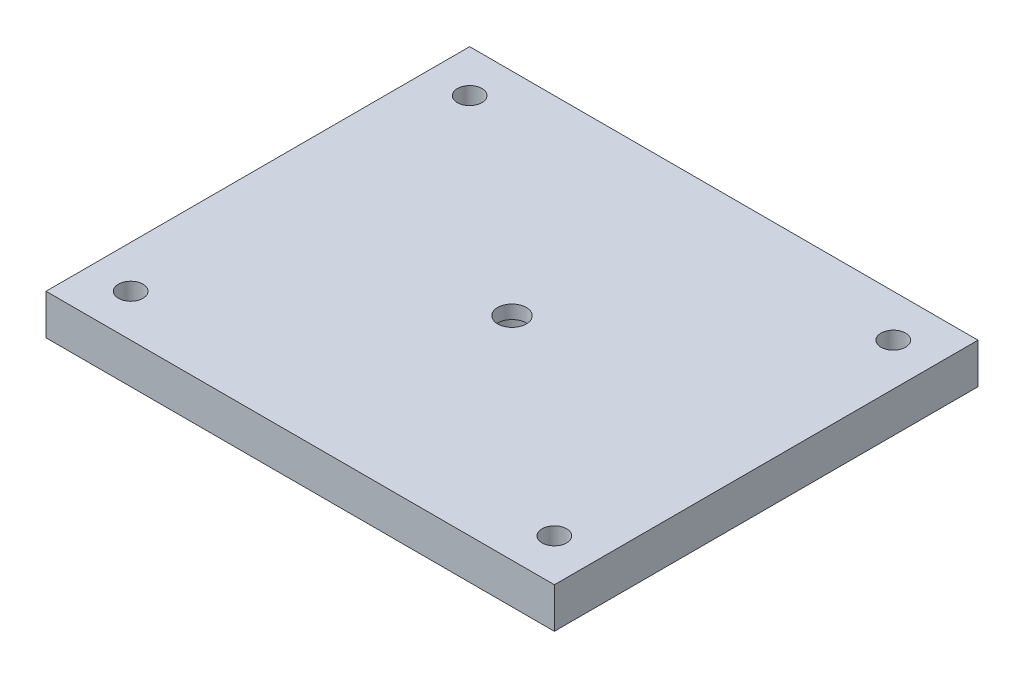
ISO-10303-21;
HEADER;
FILE_DESCRIPTION(('STEP AP214'),'2;1');
FILE_NAME('part.step','',(''),(''),'','','');
FILE_SCHEMA(('AUTOMOTIVE_DESIGN { 1 0 10303 214 1 1 1 1 }'));
ENDSEC;
DATA;
#1=APPLICATION_CONTEXT('core data for automotive mechanical design processes');
#2=APPLICATION_PROTOCOL_DEFINITION('international standard','automotive_design',2000,#1);
#3=PRODUCT_CONTEXT('',#1,'mechanical');
#4=PRODUCT('Part','Part','',(#3));
#5=PRODUCT_RELATED_PRODUCT_CATEGORY('part','',(#4));
#6=PRODUCT_DEFINITION_FORMATION('','',#4);
#7=PRODUCT_DEFINITION_CONTEXT('part definition',#1,'design');
#8=PRODUCT_DEFINITION('design','',#6,#7);
#9=PRODUCT_DEFINITION_SHAPE('','',#8);
#10=(LENGTH_UNIT() NAMED_UNIT(*) SI_UNIT(.MILLI.,.METRE.));
#11=(NAMED_UNIT(*) PLANE_ANGLE_UNIT() SI_UNIT($,.RADIAN.));
#12=(NAMED_UNIT(*) SI_UNIT($,.STERADIAN.) SOLID_ANGLE_UNIT());
#13=UNCERTAINTY_MEASURE_WITH_UNIT(LENGTH_MEASURE(1.E-05),#10,'distance_accuracy_value','');
#14=(GEOMETRIC_REPRESENTATION_CONTEXT(3) GLOBAL_UNCERTAINTY_ASSIGNED_CONTEXT((#13)) GLOBAL_UNIT_ASSIGNED_CONTEXT((#10,
#11,#12)) REPRESENTATION_CONTEXT('',''));
#15=CARTESIAN_POINT('',(0.,0.,0.));
#16=DIRECTION('',(0.,0.,1.));
#17=DIRECTION('',(1.,0.,0.));
#18=AXIS2_PLACEMENT_3D('',#15,#16,#17);
#19=CARTESIAN_POINT('',(-60.,9.525,50.));
#20=DIRECTION('',(1.,0.,0.));
#21=DIRECTION('',(0.,0.,-1.));
#22=AXIS2_PLACEMENT_3D('',#19,#20,#21);
#23=PLANE('',#22);
#24=DIRECTION('',(0.,0.,1.));
#25=VECTOR('',#24,1.);
#26=CARTESIAN_POINT('',(-60.,0.,50.));
#27=LINE('',#26,#25);
#28=CARTESIAN_POINT('',(-60.,0.,-50.));
#29=VERTEX_POINT('',#28);
#30=CARTESIAN_POINT('',(-60.,0.,50.));
#31=VERTEX_POINT('',#30);
#32=EDGE_CURVE('E95',#29,#31,#27,.T.);
#33=ORIENTED_EDGE('',*,*,#32,.T.);
#34=DIRECTION('',(0.,-1.,0.));
#35=VECTOR('',#34,1.);
#36=CARTESIAN_POINT('',(-60.,9.525,50.));
#37=LINE('',#36,#35);
#38=CARTESIAN_POINT('',(-60.,9.525,50.));
#39=VERTEX_POINT('',#38);
#40=EDGE_CURVE('E11',#39,#31,#37,.T.);
#41=ORIENTED_EDGE('',*,*,#40,.F.);
#42=DIRECTION('',(0.,0.,1.));
#43=VECTOR('',#42,1.);
#44=CARTESIAN_POINT('',(-60.,9.525,50.));
#45=LINE('',#44,#43);
#46=CARTESIAN_POINT('',(-60.,9.525,-50.));
#47=VERTEX_POINT('',#46);
#48=EDGE_CURVE('E83',#47,#39,#45,.T.);
#49=ORIENTED_EDGE('',*,*,#48,.F.);
#50=DIRECTION('',(0.,-1.,0.));
#51=VECTOR('',#50,1.);
#52=CARTESIAN_POINT('',(-60.,9.525,-50.));
#53=LINE('',#52,#51);
#54=EDGE_CURVE('E91',#47,#29,#53,.T.);
#55=ORIENTED_EDGE('',*,*,#54,.T.);
#56=EDGE_LOOP('',(#33,#41,#49,#55));
#57=FACE_BOUND('',#56,.T.);
#58=ADVANCED_FACE('F32',(#57),#23,.F.);
#59=CARTESIAN_POINT('',(60.,9.525,50.));
#60=DIRECTION('',(0.,0.,-1.));
#61=DIRECTION('',(-1.,0.,0.));
#62=AXIS2_PLACEMENT_3D('',#59,#60,#61);
#63=PLANE('',#62);
#64=DIRECTION('',(1.,0.,0.));
#65=VECTOR('',#64,1.);
#66=CARTESIAN_POINT('',(60.,0.,50.));
#67=LINE('',#66,#65);
#68=CARTESIAN_POINT('',(60.,0.,50.));
#69=VERTEX_POINT('',#68);
#70=EDGE_CURVE('E87',#31,#69,#67,.T.);
#71=ORIENTED_EDGE('',*,*,#70,.T.);
#72=DIRECTION('',(0.,-1.,0.));
#73=VECTOR('',#72,1.);
#74=CARTESIAN_POINT('',(60.,9.525,50.));
#75=LINE('',#74,#73);
#76=CARTESIAN_POINT('',(60.,9.525,50.));
#77=VERTEX_POINT('',#76);
#78=EDGE_CURVE('E40',#77,#69,#75,.T.);
#79=ORIENTED_EDGE('',*,*,#78,.F.);
#80=DIRECTION('',(1.,0.,0.));
#81=VECTOR('',#80,1.);
#82=CARTESIAN_POINT('',(60.,9.525,50.));
#83=LINE('',#82,#81);
#84=EDGE_CURVE('E78',#39,#77,#83,.T.);
#85=ORIENTED_EDGE('',*,*,#84,.F.);
#86=ORIENTED_EDGE('',*,*,#40,.T.);
#87=EDGE_LOOP('',(#71,#79,#85,#86));
#88=FACE_BOUND('',#87,.T.);
#89=ADVANCED_FACE('F86',(#88),#63,.F.);
#90=CARTESIAN_POINT('',(60.,9.525,50.));
#91=DIRECTION('',(-1.,0.,0.));
#92=DIRECTION('',(0.,0.,1.));
#93=AXIS2_PLACEMENT_3D('',#90,#91,#92);
#94=PLANE('',#93);
#95=DIRECTION('',(0.,0.,-1.));
#96=VECTOR('',#95,1.);
#97=CARTESIAN_POINT('',(60.,0.,50.));
#98=LINE('',#97,#96);
#99=CARTESIAN_POINT('',(60.,0.,-50.));
#100=VERTEX_POINT('',#99);
#101=EDGE_CURVE('E65',#69,#100,#98,.T.);
#102=ORIENTED_EDGE('',*,*,#101,.T.);
#103=DIRECTION('',(0.,-1.,0.));
#104=VECTOR('',#103,1.);
#105=CARTESIAN_POINT('',(60.,9.525,-50.));
#106=LINE('',#105,#104);
#107=CARTESIAN_POINT('',(60.,9.525,-50.));
#108=VERTEX_POINT('',#107);
#109=EDGE_CURVE('E88',#108,#100,#106,.T.);
#110=ORIENTED_EDGE('',*,*,#109,.F.);
#111=DIRECTION('',(0.,0.,-1.));
#112=VECTOR('',#111,1.);
#113=CARTESIAN_POINT('',(60.,9.525,50.));
#114=LINE('',#113,#112);
#115=EDGE_CURVE('E81',#77,#108,#114,.T.);
#116=ORIENTED_EDGE('',*,*,#115,.F.);
#117=ORIENTED_EDGE('',*,*,#78,.T.);
#118=EDGE_LOOP('',(#102,#110,#116,#117));
#119=FACE_BOUND('',#118,.T.);
#120=ADVANCED_FACE('F89',(#119),#94,.F.);
#121=CARTESIAN_POINT('',(60.,9.525,-50.));
#122=DIRECTION('',(0.,0.,1.));
#123=DIRECTION('',(1.,0.,0.));
#124=AXIS2_PLACEMENT_3D('',#121,#122,#123);
#125=PLANE('',#124);
#126=DIRECTION('',(-1.,0.,0.));
#127=VECTOR('',#126,1.);
#128=CARTESIAN_POINT('',(60.,0.,-50.));
#129=LINE('',#128,#127);
#130=EDGE_CURVE('E71',#100,#29,#129,.T.);
#131=ORIENTED_EDGE('',*,*,#130,.T.);
#132=ORIENTED_EDGE('',*,*,#54,.F.);
#133=DIRECTION('',(-1.,0.,0.));
#134=VECTOR('',#133,1.);
#135=CARTESIAN_POINT('',(60.,9.525,-50.));
#136=LINE('',#135,#134);
#137=EDGE_CURVE('E48',#108,#47,#136,.T.);
#138=ORIENTED_EDGE('',*,*,#137,.F.);
#139=ORIENTED_EDGE('',*,*,#109,.T.);
#140=EDGE_LOOP('',(#131,#132,#138,#139));
#141=FACE_BOUND('',#140,.T.);
#142=ADVANCED_FACE('F103',(#141),#125,.F.);
#143=CARTESIAN_POINT('',(0.,9.525,0.));
#144=DIRECTION('',(0.,1.,0.));
#145=DIRECTION('',(0.,0.,1.));
#146=AXIS2_PLACEMENT_3D('',#143,#144,#145);
#147=PLANE('',#146);
#148=CARTESIAN_POINT('',(0.,9.525,0.));
#149=DIRECTION('',(0.,-1.,0.));
#150=DIRECTION('',(0.,0.,-1.));
#151=AXIS2_PLACEMENT_3D('',#148,#149,#150);
#152=CIRCLE('',#151,3.3782);
#153=CARTESIAN_POINT('',(0.,9.525,-3.3782));
#154=VERTEX_POINT('',#153);
#155=EDGE_CURVE('E132',#154,#154,#152,.T.);
#156=ORIENTED_EDGE('',*,*,#155,.T.);
#157=EDGE_LOOP('',(#156));
#158=FACE_BOUND('',#157,.T.);
#159=CARTESIAN_POINT('',(-50.,9.525,40.));
#160=DIRECTION('',(0.,1.,0.));
#161=DIRECTION('',(0.,0.,1.));
#162=AXIS2_PLACEMENT_3D('',#159,#160,#161);
#163=CIRCLE('',#162,2.89999999999999);
#164=CARTESIAN_POINT('',(-50.,9.525,42.9));
#165=VERTEX_POINT('',#164);
#166=EDGE_CURVE('E129',#165,#165,#163,.T.);
#167=ORIENTED_EDGE('',*,*,#166,.F.);
#168=EDGE_LOOP('',(#167));
#169=FACE_BOUND('',#168,.T.);
#170=CARTESIAN_POINT('',(-50.,9.525,-40.));
#171=DIRECTION('',(0.,1.,0.));
#172=DIRECTION('',(0.,0.,1.));
#173=AXIS2_PLACEMENT_3D('',#170,#171,#172);
#174=CIRCLE('',#173,2.89999999999999);
#175=CARTESIAN_POINT('',(-50.,9.525,-37.1));
#176=VERTEX_POINT('',#175);
#177=EDGE_CURVE('E123',#176,#176,#174,.T.);
#178=ORIENTED_EDGE('',*,*,#177,.F.);
#179=EDGE_LOOP('',(#178));
#180=FACE_BOUND('',#179,.T.);
#181=CARTESIAN_POINT('',(50.,9.525,-40.));
#182=DIRECTION('',(0.,1.,0.));
#183=DIRECTION('',(0.,0.,1.));
#184=AXIS2_PLACEMENT_3D('',#181,#182,#183);
#185=CIRCLE('',#184,2.89999999999999);
#186=CARTESIAN_POINT('',(50.,9.525,-37.1));
#187=VERTEX_POINT('',#186);
#188=EDGE_CURVE('E117',#187,#187,#185,.T.);
#189=ORIENTED_EDGE('',*,*,#188,.F.);
#190=EDGE_LOOP('',(#189));
#191=FACE_BOUND('',#190,.T.);
#192=CARTESIAN_POINT('',(50.,9.525,40.));
#193=DIRECTION('',(0.,1.,0.));
#194=DIRECTION('',(0.,0.,1.));
#195=AXIS2_PLACEMENT_3D('',#192,#193,#194);
#196=CIRCLE('',#195,2.89999999999999);
#197=CARTESIAN_POINT('',(50.,9.525,42.9));
#198=VERTEX_POINT('',#197);
#199=EDGE_CURVE('E111',#198,#198,#196,.T.);
#200=ORIENTED_EDGE('',*,*,#199,.F.);
#201=EDGE_LOOP('',(#200));
#202=FACE_BOUND('',#201,.T.);
#203=ORIENTED_EDGE('',*,*,#48,.T.);
#204=ORIENTED_EDGE('',*,*,#84,.T.);
#205=ORIENTED_EDGE('',*,*,#115,.T.);
#206=ORIENTED_EDGE('',*,*,#137,.T.);
#207=EDGE_LOOP('',(#203,#204,#205,#206));
#208=FACE_BOUND('',#207,.T.);
#209=ADVANCED_FACE('F79',(#158,#169,#180,#191,#202,#208),#147,.T.);
#210=CARTESIAN_POINT('',(0.,0.,0.));
#211=DIRECTION('',(0.,1.,0.));
#212=DIRECTION('',(0.,0.,1.));
#213=AXIS2_PLACEMENT_3D('',#210,#211,#212);
#214=PLANE('',#213);
#215=CARTESIAN_POINT('',(0.,0.,0.));
#216=DIRECTION('',(0.,-1.,0.));
#217=DIRECTION('',(0.,0.,-1.));
#218=AXIS2_PLACEMENT_3D('',#215,#216,#217);
#219=CIRCLE('',#218,5.55625);
#220=CARTESIAN_POINT('',(0.,0.,-5.55625));
#221=VERTEX_POINT('',#220);
#222=EDGE_CURVE('E141',#221,#221,#219,.T.);
#223=ORIENTED_EDGE('',*,*,#222,.F.);
#224=EDGE_LOOP('',(#223));
#225=FACE_BOUND('',#224,.T.);
#226=CARTESIAN_POINT('',(-50.,0.,40.));
#227=DIRECTION('',(0.,1.,0.));
#228=DIRECTION('',(0.,0.,1.));
#229=AXIS2_PLACEMENT_3D('',#226,#227,#228);
#230=CIRCLE('',#229,2.9);
#231=CARTESIAN_POINT('',(-50.,0.,42.9));
#232=VERTEX_POINT('',#231);
#233=EDGE_CURVE('E126',#232,#232,#230,.T.);
#234=ORIENTED_EDGE('',*,*,#233,.T.);
#235=EDGE_LOOP('',(#234));
#236=FACE_BOUND('',#235,.T.);
#237=CARTESIAN_POINT('',(-50.,0.,-40.));
#238=DIRECTION('',(0.,1.,0.));
#239=DIRECTION('',(0.,0.,1.));
#240=AXIS2_PLACEMENT_3D('',#237,#238,#239);
#241=CIRCLE('',#240,2.9);
#242=CARTESIAN_POINT('',(-50.,0.,-37.1));
#243=VERTEX_POINT('',#242);
#244=EDGE_CURVE('E120',#243,#243,#241,.T.);
#245=ORIENTED_EDGE('',*,*,#244,.T.);
#246=EDGE_LOOP('',(#245));
#247=FACE_BOUND('',#246,.T.);
#248=CARTESIAN_POINT('',(50.,0.,-40.));
#249=DIRECTION('',(0.,1.,0.));
#250=DIRECTION('',(0.,0.,1.));
#251=AXIS2_PLACEMENT_3D('',#248,#249,#250);
#252=CIRCLE('',#251,2.9);
#253=CARTESIAN_POINT('',(50.,0.,-37.1));
#254=VERTEX_POINT('',#253);
#255=EDGE_CURVE('E114',#254,#254,#252,.T.);
#256=ORIENTED_EDGE('',*,*,#255,.T.);
#257=EDGE_LOOP('',(#256));
#258=FACE_BOUND('',#257,.T.);
#259=CARTESIAN_POINT('',(50.,0.,40.));
#260=DIRECTION('',(0.,1.,0.));
#261=DIRECTION('',(0.,0.,1.));
#262=AXIS2_PLACEMENT_3D('',#259,#260,#261);
#263=CIRCLE('',#262,2.9);
#264=CARTESIAN_POINT('',(50.,0.,42.9));
#265=VERTEX_POINT('',#264);
#266=EDGE_CURVE('E98',#265,#265,#263,.T.);
#267=ORIENTED_EDGE('',*,*,#266,.T.);
#268=EDGE_LOOP('',(#267));
#269=FACE_BOUND('',#268,.T.);
#270=ORIENTED_EDGE('',*,*,#32,.F.);
#271=ORIENTED_EDGE('',*,*,#130,.F.);
#272=ORIENTED_EDGE('',*,*,#101,.F.);
#273=ORIENTED_EDGE('',*,*,#70,.F.);
#274=EDGE_LOOP('',(#270,#271,#272,#273));
#275=FACE_BOUND('',#274,.T.);
#276=ADVANCED_FACE('F106',(#225,#236,#247,#258,#269,#275),#214,.F.);
#277=CARTESIAN_POINT('',(50.,9.525,40.));
#278=DIRECTION('',(0.,1.,0.));
#279=DIRECTION('',(0.,0.,1.));
#280=AXIS2_PLACEMENT_3D('',#277,#278,#279);
#281=CYLINDRICAL_SURFACE('',#280,2.89999999999999);
#282=ORIENTED_EDGE('',*,*,#266,.F.);
#283=EDGE_LOOP('',(#282));
#284=FACE_BOUND('',#283,.T.);
#285=ORIENTED_EDGE('',*,*,#199,.T.);
#286=EDGE_LOOP('',(#285));
#287=FACE_BOUND('',#286,.T.);
#288=ADVANCED_FACE('F149',(#284,#287),#281,.F.);
#289=CARTESIAN_POINT('',(50.,9.525,-40.));
#290=DIRECTION('',(0.,1.,0.));
#291=DIRECTION('',(0.,0.,1.));
#292=AXIS2_PLACEMENT_3D('',#289,#290,#291);
#293=CYLINDRICAL_SURFACE('',#292,2.89999999999999);
#294=ORIENTED_EDGE('',*,*,#255,.F.);
#295=EDGE_LOOP('',(#294));
#296=FACE_BOUND('',#295,.T.);
#297=ORIENTED_EDGE('',*,*,#188,.T.);
#298=EDGE_LOOP('',(#297));
#299=FACE_BOUND('',#298,.T.);
#300=ADVANCED_FACE('F161',(#296,#299),#293,.F.);
#301=CARTESIAN_POINT('',(-50.,9.525,-40.));
#302=DIRECTION('',(0.,1.,0.));
#303=DIRECTION('',(0.,0.,1.));
#304=AXIS2_PLACEMENT_3D('',#301,#302,#303);
#305=CYLINDRICAL_SURFACE('',#304,2.89999999999999);
#306=ORIENTED_EDGE('',*,*,#244,.F.);
#307=EDGE_LOOP('',(#306));
#308=FACE_BOUND('',#307,.T.);
#309=ORIENTED_EDGE('',*,*,#177,.T.);
#310=EDGE_LOOP('',(#309));
#311=FACE_BOUND('',#310,.T.);
#312=ADVANCED_FACE('F204',(#308,#311),#305,.F.);
#313=CARTESIAN_POINT('',(-50.,9.525,40.));
#314=DIRECTION('',(0.,1.,0.));
#315=DIRECTION('',(0.,0.,1.));
#316=AXIS2_PLACEMENT_3D('',#313,#314,#315);
#317=CYLINDRICAL_SURFACE('',#316,2.89999999999999);
#318=ORIENTED_EDGE('',*,*,#233,.F.);
#319=EDGE_LOOP('',(#318));
#320=FACE_BOUND('',#319,.T.);
#321=ORIENTED_EDGE('',*,*,#166,.T.);
#322=EDGE_LOOP('',(#321));
#323=FACE_BOUND('',#322,.T.);
#324=ADVANCED_FACE('F214',(#320,#323),#317,.F.);
#325=CARTESIAN_POINT('',(0.,0.,0.));
#326=DIRECTION('',(0.,-1.,0.));
#327=DIRECTION('',(0.,0.,-1.));
#328=AXIS2_PLACEMENT_3D('',#325,#326,#327);
#329=CYLINDRICAL_SURFACE('',#328,3.3782);
#330=ORIENTED_EDGE('',*,*,#155,.F.);
#331=EDGE_LOOP('',(#330));
#332=FACE_BOUND('',#331,.T.);
#333=CARTESIAN_POINT('',(0.,6.35,0.));
#334=DIRECTION('',(0.,-1.,0.));
#335=DIRECTION('',(0.,0.,-1.));
#336=AXIS2_PLACEMENT_3D('',#333,#334,#335);
#337=CIRCLE('',#336,3.3782);
#338=CARTESIAN_POINT('',(0.,6.35,-3.3782));
#339=VERTEX_POINT('',#338);
#340=EDGE_CURVE('E135',#339,#339,#337,.T.);
#341=ORIENTED_EDGE('',*,*,#340,.T.);
#342=EDGE_LOOP('',(#341));
#343=FACE_BOUND('',#342,.T.);
#344=ADVANCED_FACE('F223',(#332,#343),#329,.F.);
#345=CARTESIAN_POINT('',(3.3782,6.35,0.));
#346=DIRECTION('',(0.,1.,0.));
#347=DIRECTION('',(0.,0.,1.));
#348=AXIS2_PLACEMENT_3D('',#345,#346,#347);
#349=PLANE('',#348);
#350=ORIENTED_EDGE('',*,*,#340,.F.);
#351=EDGE_LOOP('',(#350));
#352=FACE_BOUND('',#351,.T.);
#353=CARTESIAN_POINT('',(0.,6.35,0.));
#354=DIRECTION('',(0.,-1.,0.));
#355=DIRECTION('',(0.,0.,-1.));
#356=AXIS2_PLACEMENT_3D('',#353,#354,#355);
#357=CIRCLE('',#356,5.55625);
#358=CARTESIAN_POINT('',(0.,6.35,-5.55625));
#359=VERTEX_POINT('',#358);
#360=EDGE_CURVE('E138',#359,#359,#357,.T.);
#361=ORIENTED_EDGE('',*,*,#360,.T.);
#362=EDGE_LOOP('',(#361));
#363=FACE_BOUND('',#362,.T.);
#364=ADVANCED_FACE('F242',(#352,#363),#349,.F.);
#365=CARTESIAN_POINT('',(0.,0.,0.));
#366=DIRECTION('',(0.,-1.,0.));
#367=DIRECTION('',(0.,0.,-1.));
#368=AXIS2_PLACEMENT_3D('',#365,#366,#367);
#369=CYLINDRICAL_SURFACE('',#368,5.55625);
#370=ORIENTED_EDGE('',*,*,#360,.F.);
#371=EDGE_LOOP('',(#370));
#372=FACE_BOUND('',#371,.T.);
#373=ORIENTED_EDGE('',*,*,#222,.T.);
#374=EDGE_LOOP('',(#373));
#375=FACE_BOUND('',#374,.T.);
#376=ADVANCED_FACE('F145',(#372,#375),#369,.F.);
#377=CLOSED_SHELL('',(#58,#89,#120,#142,#209,#276,#288,#300,#312,#324,#344,#364,#376));
#378=MANIFOLD_SOLID_BREP('B2',#377);
#379=ADVANCED_BREP_SHAPE_REPRESENTATION('',(#18,#378),#14);
#380=SHAPE_DEFINITION_REPRESENTATION(#9,#379);
ENDSEC;
END-ISO-10303-21;
